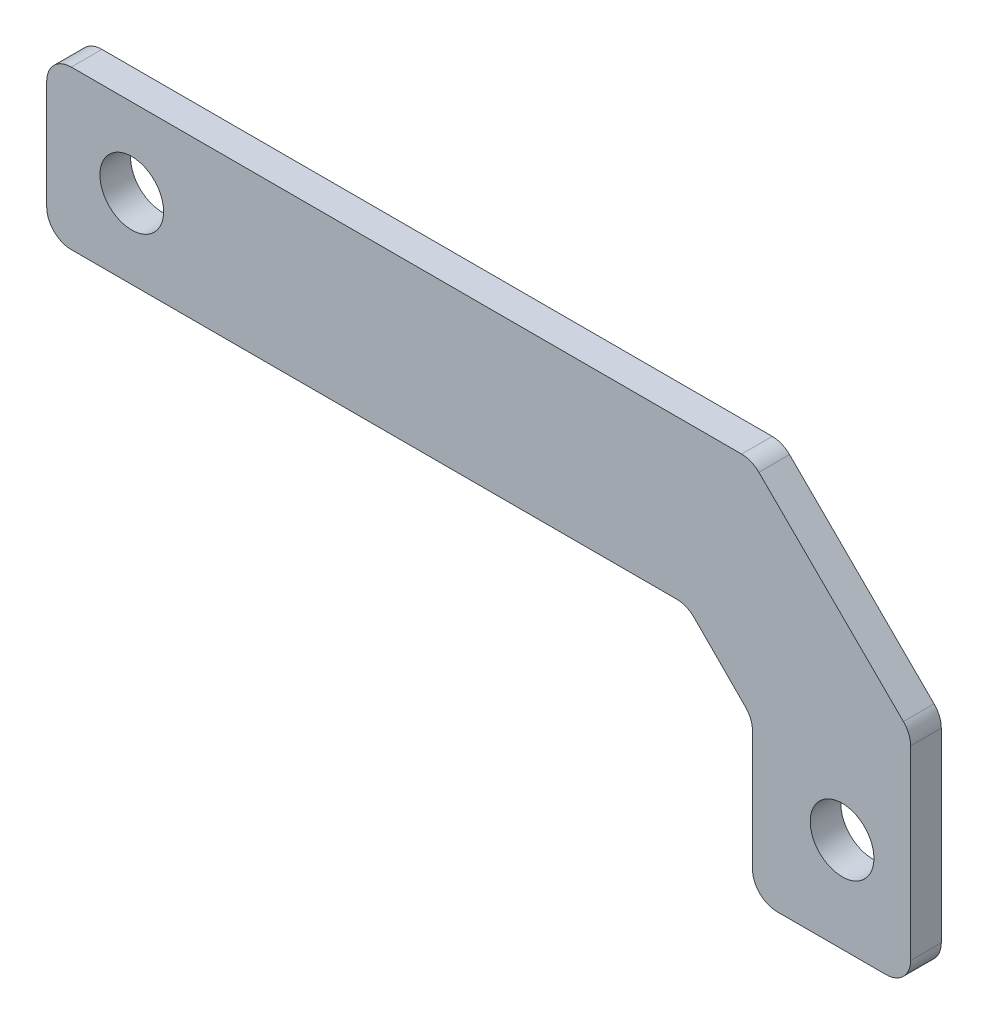
ISO-10303-21;
HEADER;
FILE_DESCRIPTION(('STEP AP214'),'2;1');
FILE_NAME('part.step','',(''),(''),'','','');
FILE_SCHEMA(('AUTOMOTIVE_DESIGN { 1 0 10303 214 1 1 1 1 }'));
ENDSEC;
DATA;
#1=APPLICATION_CONTEXT('core data for automotive mechanical design processes');
#2=APPLICATION_PROTOCOL_DEFINITION('international standard','automotive_design',2000,#1);
#3=PRODUCT_CONTEXT('',#1,'mechanical');
#4=PRODUCT('Part','Part','',(#3));
#5=PRODUCT_RELATED_PRODUCT_CATEGORY('part','',(#4));
#6=PRODUCT_DEFINITION_FORMATION('','',#4);
#7=PRODUCT_DEFINITION_CONTEXT('part definition',#1,'design');
#8=PRODUCT_DEFINITION('design','',#6,#7);
#9=PRODUCT_DEFINITION_SHAPE('','',#8);
#10=(LENGTH_UNIT() NAMED_UNIT(*) SI_UNIT(.MILLI.,.METRE.));
#11=(NAMED_UNIT(*) PLANE_ANGLE_UNIT() SI_UNIT($,.RADIAN.));
#12=(NAMED_UNIT(*) SI_UNIT($,.STERADIAN.) SOLID_ANGLE_UNIT());
#13=UNCERTAINTY_MEASURE_WITH_UNIT(LENGTH_MEASURE(1.E-05),#10,'distance_accuracy_value','');
#14=(GEOMETRIC_REPRESENTATION_CONTEXT(3) GLOBAL_UNCERTAINTY_ASSIGNED_CONTEXT((#13)) GLOBAL_UNIT_ASSIGNED_CONTEXT((#10,
#11,#12)) REPRESENTATION_CONTEXT('',''));
#15=CARTESIAN_POINT('',(0.,0.,0.));
#16=DIRECTION('',(0.,0.,1.));
#17=DIRECTION('',(1.,0.,0.));
#18=AXIS2_PLACEMENT_3D('',#15,#16,#17);
#19=CARTESIAN_POINT('',(-25.8191520170898,-78.501600001198,-3.175));
#20=DIRECTION('',(-1.,0.,0.));
#21=DIRECTION('',(0.,-1.,0.));
#22=AXIS2_PLACEMENT_3D('',#19,#20,#21);
#23=PLANE('',#22);
#24=DIRECTION('',(0.,-1.,0.));
#25=VECTOR('',#24,1.);
#26=CARTESIAN_POINT('',(-25.8191520170898,-78.501600001198,0.));
#27=LINE('',#26,#25);
#28=CARTESIAN_POINT('',(-25.8191520170898,-64.663600001198,0.));
#29=VERTEX_POINT('',#28);
#30=CARTESIAN_POINT('',(-25.8191520170898,-75.961600001198,0.));
#31=VERTEX_POINT('',#30);
#32=EDGE_CURVE('E278',#29,#31,#27,.T.);
#33=ORIENTED_EDGE('',*,*,#32,.F.);
#34=DIRECTION('',(0.,0.,1.));
#35=VECTOR('',#34,1.);
#36=CARTESIAN_POINT('',(-25.8191520170898,-64.663600001198,-3.175));
#37=LINE('',#36,#35);
#38=CARTESIAN_POINT('',(-25.8191520170898,-64.663600001198,-3.175));
#39=VERTEX_POINT('',#38);
#40=EDGE_CURVE('E237',#29,#39,#37,.F.);
#41=ORIENTED_EDGE('',*,*,#40,.T.);
#42=DIRECTION('',(0.,-1.,0.));
#43=VECTOR('',#42,1.);
#44=CARTESIAN_POINT('',(-25.8191520170898,-78.501600001198,-3.175));
#45=LINE('',#44,#43);
#46=CARTESIAN_POINT('',(-25.8191520170898,-75.961600001198,-3.175));
#47=VERTEX_POINT('',#46);
#48=EDGE_CURVE('E261',#39,#47,#45,.T.);
#49=ORIENTED_EDGE('',*,*,#48,.T.);
#50=DIRECTION('',(0.,0.,1.));
#51=VECTOR('',#50,1.);
#52=CARTESIAN_POINT('',(-25.8191520170898,-75.961600001198,-3.175));
#53=LINE('',#52,#51);
#54=EDGE_CURVE('E234',#47,#31,#53,.T.);
#55=ORIENTED_EDGE('',*,*,#54,.T.);
#56=EDGE_LOOP('',(#33,#41,#49,#55));
#57=FACE_BOUND('',#56,.T.);
#58=ADVANCED_FACE('F40',(#57),#23,.T.);
#59=CARTESIAN_POINT('',(47.2058479829102,-62.123600001198,-3.175));
#60=DIRECTION('',(0.,1.,0.));
#61=DIRECTION('',(0.,0.,1.));
#62=AXIS2_PLACEMENT_3D('',#59,#60,#61);
#63=PLANE('',#62);
#64=DIRECTION('',(-1.,0.,0.));
#65=VECTOR('',#64,1.);
#66=CARTESIAN_POINT('',(47.2058479829102,-62.123600001198,0.));
#67=LINE('',#66,#65);
#68=CARTESIAN_POINT('',(46.1585043401581,-62.123600001198,0.));
#69=VERTEX_POINT('',#68);
#70=CARTESIAN_POINT('',(-23.2791520170898,-62.123600001198,0.));
#71=VERTEX_POINT('',#70);
#72=EDGE_CURVE('E174',#69,#71,#67,.T.);
#73=ORIENTED_EDGE('',*,*,#72,.F.);
#74=DIRECTION('',(0.,0.,1.));
#75=VECTOR('',#74,1.);
#76=CARTESIAN_POINT('',(46.1585043401581,-62.123600001198,-3.175));
#77=LINE('',#76,#75);
#78=CARTESIAN_POINT('',(46.1585043401581,-62.123600001198,-3.175));
#79=VERTEX_POINT('',#78);
#80=EDGE_CURVE('E198',#69,#79,#77,.F.);
#81=ORIENTED_EDGE('',*,*,#80,.T.);
#82=DIRECTION('',(-1.,0.,0.));
#83=VECTOR('',#82,1.);
#84=CARTESIAN_POINT('',(47.2058479829102,-62.123600001198,-3.175));
#85=LINE('',#84,#83);
#86=CARTESIAN_POINT('',(-23.2791520170898,-62.123600001198,-3.175));
#87=VERTEX_POINT('',#86);
#88=EDGE_CURVE('E179',#79,#87,#85,.T.);
#89=ORIENTED_EDGE('',*,*,#88,.T.);
#90=DIRECTION('',(0.,0.,1.));
#91=VECTOR('',#90,1.);
#92=CARTESIAN_POINT('',(-23.2791520170898,-62.123600001198,-3.175));
#93=LINE('',#92,#91);
#94=EDGE_CURVE('E195',#87,#71,#93,.T.);
#95=ORIENTED_EDGE('',*,*,#94,.T.);
#96=EDGE_LOOP('',(#73,#81,#89,#95));
#97=FACE_BOUND('',#96,.T.);
#98=ADVANCED_FACE('F319',(#97),#63,.T.);
#99=CARTESIAN_POINT('',(63.6677250495303,-78.4804417272799,-3.175));
#100=DIRECTION('',(0.704840096977084,0.709366222548927,0.));
#101=DIRECTION('',(-0.709366222548927,0.704840096977085,0.));
#102=AXIS2_PLACEMENT_3D('',#99,#100,#101);
#103=PLANE('',#102);
#104=DIRECTION('',(-0.709366222548927,0.704840096977085,0.));
#105=VECTOR('',#104,1.);
#106=CARTESIAN_POINT('',(63.6677250495303,-78.4804417272799,-3.175));
#107=LINE('',#106,#105);
#108=CARTESIAN_POINT('',(62.9180188958521,-77.7355190889223,-3.175));
#109=VERTEX_POINT('',#108);
#110=CARTESIAN_POINT('',(47.9487981864799,-62.8618097959237,-3.175));
#111=VERTEX_POINT('',#110);
#112=EDGE_CURVE('E184',#109,#111,#107,.T.);
#113=ORIENTED_EDGE('',*,*,#112,.T.);
#114=DIRECTION('',(0.,0.,1.));
#115=VECTOR('',#114,1.);
#116=CARTESIAN_POINT('',(47.9487981864799,-62.8618097959237,-3.175));
#117=LINE('',#116,#115);
#118=CARTESIAN_POINT('',(47.9487981864799,-62.8618097959237,0.));
#119=VERTEX_POINT('',#118);
#120=EDGE_CURVE('E173',#111,#119,#117,.T.);
#121=ORIENTED_EDGE('',*,*,#120,.T.);
#122=DIRECTION('',(-0.709366222548927,0.704840096977085,0.));
#123=VECTOR('',#122,1.);
#124=CARTESIAN_POINT('',(63.6677250495303,-78.4804417272799,0.));
#125=LINE('',#124,#123);
#126=CARTESIAN_POINT('',(62.9180188958521,-77.7355190889223,0.));
#127=VERTEX_POINT('',#126);
#128=EDGE_CURVE('E156',#127,#119,#125,.T.);
#129=ORIENTED_EDGE('',*,*,#128,.F.);
#130=DIRECTION('',(0.,0.,1.));
#131=VECTOR('',#130,1.);
#132=CARTESIAN_POINT('',(62.9180188958521,-77.7355190889223,-3.175));
#133=LINE('',#132,#131);
#134=EDGE_CURVE('E170',#127,#109,#133,.F.);
#135=ORIENTED_EDGE('',*,*,#134,.T.);
#136=EDGE_LOOP('',(#113,#121,#129,#135));
#137=FACE_BOUND('',#136,.T.);
#138=ADVANCED_FACE('F169',(#137),#103,.T.);
#139=CARTESIAN_POINT('',(63.6677250495303,-78.4804417272799,-3.175));
#140=DIRECTION('',(1.,0.,0.));
#141=DIRECTION('',(0.,0.,-1.));
#142=AXIS2_PLACEMENT_3D('',#139,#140,#141);
#143=PLANE('',#142);
#144=DIRECTION('',(0.,1.,0.));
#145=VECTOR('',#144,1.);
#146=CARTESIAN_POINT('',(63.6677250495303,-78.4804417272799,-3.175));
#147=LINE('',#146,#145);
#148=CARTESIAN_POINT('',(63.6677250495303,-98.8004417272799,-3.175));
#149=VERTEX_POINT('',#148);
#150=CARTESIAN_POINT('',(63.6677250495303,-79.5373092941966,-3.175));
#151=VERTEX_POINT('',#150);
#152=EDGE_CURVE('E274',#149,#151,#147,.T.);
#153=ORIENTED_EDGE('',*,*,#152,.T.);
#154=DIRECTION('',(0.,0.,1.));
#155=VECTOR('',#154,1.);
#156=CARTESIAN_POINT('',(63.6677250495303,-79.5373092941966,-3.175));
#157=LINE('',#156,#155);
#158=CARTESIAN_POINT('',(63.6677250495303,-79.5373092941966,0.));
#159=VERTEX_POINT('',#158);
#160=EDGE_CURVE('E213',#151,#159,#157,.T.);
#161=ORIENTED_EDGE('',*,*,#160,.T.);
#162=DIRECTION('',(0.,1.,0.));
#163=VECTOR('',#162,1.);
#164=CARTESIAN_POINT('',(63.6677250495303,-78.4804417272799,0.));
#165=LINE('',#164,#163);
#166=CARTESIAN_POINT('',(63.6677250495303,-98.8004417272799,0.));
#167=VERTEX_POINT('',#166);
#168=EDGE_CURVE('E158',#167,#159,#165,.T.);
#169=ORIENTED_EDGE('',*,*,#168,.F.);
#170=DIRECTION('',(0.,0.,1.));
#171=VECTOR('',#170,1.);
#172=CARTESIAN_POINT('',(63.6677250495303,-98.8004417272799,-3.175));
#173=LINE('',#172,#171);
#174=EDGE_CURVE('E211',#167,#149,#173,.F.);
#175=ORIENTED_EDGE('',*,*,#174,.T.);
#176=EDGE_LOOP('',(#153,#161,#169,#175));
#177=FACE_BOUND('',#176,.T.);
#178=ADVANCED_FACE('F369',(#177),#143,.T.);
#179=CARTESIAN_POINT('',(63.6677250495303,-101.34044172728,-3.175));
#180=DIRECTION('',(0.,-1.,0.));
#181=DIRECTION('',(0.,0.,-1.));
#182=AXIS2_PLACEMENT_3D('',#179,#180,#181);
#183=PLANE('',#182);
#184=DIRECTION('',(1.,0.,0.));
#185=VECTOR('',#184,1.);
#186=CARTESIAN_POINT('',(63.6677250495303,-101.34044172728,-3.175));
#187=LINE('',#186,#185);
#188=CARTESIAN_POINT('',(49.8297250495303,-101.34044172728,-3.175));
#189=VERTEX_POINT('',#188);
#190=CARTESIAN_POINT('',(61.1277250495303,-101.34044172728,-3.175));
#191=VERTEX_POINT('',#190);
#192=EDGE_CURVE('E271',#189,#191,#187,.T.);
#193=ORIENTED_EDGE('',*,*,#192,.T.);
#194=DIRECTION('',(0.,0.,1.));
#195=VECTOR('',#194,1.);
#196=CARTESIAN_POINT('',(61.1277250495303,-101.34044172728,-3.175));
#197=LINE('',#196,#195);
#198=CARTESIAN_POINT('',(61.1277250495303,-101.34044172728,0.));
#199=VERTEX_POINT('',#198);
#200=EDGE_CURVE('E231',#191,#199,#197,.T.);
#201=ORIENTED_EDGE('',*,*,#200,.T.);
#202=DIRECTION('',(1.,0.,0.));
#203=VECTOR('',#202,1.);
#204=CARTESIAN_POINT('',(63.6677250495303,-101.34044172728,0.));
#205=LINE('',#204,#203);
#206=CARTESIAN_POINT('',(49.8297250495303,-101.34044172728,0.));
#207=VERTEX_POINT('',#206);
#208=EDGE_CURVE('E285',#207,#199,#205,.T.);
#209=ORIENTED_EDGE('',*,*,#208,.F.);
#210=DIRECTION('',(0.,0.,1.));
#211=VECTOR('',#210,1.);
#212=CARTESIAN_POINT('',(49.8297250495303,-101.34044172728,-3.175));
#213=LINE('',#212,#211);
#214=EDGE_CURVE('E229',#207,#189,#213,.F.);
#215=ORIENTED_EDGE('',*,*,#214,.T.);
#216=EDGE_LOOP('',(#193,#201,#209,#215));
#217=FACE_BOUND('',#216,.T.);
#218=ADVANCED_FACE('F291',(#217),#183,.T.);
#219=CARTESIAN_POINT('',(47.2897250495303,-85.3384417272799,-3.175));
#220=DIRECTION('',(-1.,0.,0.));
#221=DIRECTION('',(0.,0.,1.));
#222=AXIS2_PLACEMENT_3D('',#219,#220,#221);
#223=PLANE('',#222);
#224=DIRECTION('',(0.,-1.,0.));
#225=VECTOR('',#224,1.);
#226=CARTESIAN_POINT('',(47.2897250495303,-85.3384417272799,0.));
#227=LINE('',#226,#225);
#228=CARTESIAN_POINT('',(47.2897250495303,-86.3858291351187,0.));
#229=VERTEX_POINT('',#228);
#230=CARTESIAN_POINT('',(47.2897250495303,-98.8004417272799,0.));
#231=VERTEX_POINT('',#230);
#232=EDGE_CURVE('E254',#229,#231,#227,.T.);
#233=ORIENTED_EDGE('',*,*,#232,.F.);
#234=DIRECTION('',(0.,0.,1.));
#235=VECTOR('',#234,1.);
#236=CARTESIAN_POINT('',(47.2897250495303,-86.3858291351187,-3.175));
#237=LINE('',#236,#235);
#238=CARTESIAN_POINT('',(47.2897250495303,-86.3858291351187,-3.175));
#239=VERTEX_POINT('',#238);
#240=EDGE_CURVE('E223',#229,#239,#237,.F.);
#241=ORIENTED_EDGE('',*,*,#240,.T.);
#242=DIRECTION('',(0.,-1.,0.));
#243=VECTOR('',#242,1.);
#244=CARTESIAN_POINT('',(47.2897250495303,-85.3384417272799,-3.175));
#245=LINE('',#244,#243);
#246=CARTESIAN_POINT('',(47.2897250495303,-98.8004417272799,-3.175));
#247=VERTEX_POINT('',#246);
#248=EDGE_CURVE('E263',#239,#247,#245,.T.);
#249=ORIENTED_EDGE('',*,*,#248,.T.);
#250=DIRECTION('',(0.,0.,1.));
#251=VECTOR('',#250,1.);
#252=CARTESIAN_POINT('',(47.2897250495303,-98.8004417272799,-3.175));
#253=LINE('',#252,#251);
#254=EDGE_CURVE('E220',#247,#231,#253,.T.);
#255=ORIENTED_EDGE('',*,*,#254,.T.);
#256=EDGE_LOOP('',(#233,#241,#249,#255));
#257=FACE_BOUND('',#256,.T.);
#258=ADVANCED_FACE('F304',(#257),#223,.T.);
#259=CARTESIAN_POINT('',(40.496105752232,-78.501600001198,-3.175));
#260=DIRECTION('',(-0.709345462728307,-0.704860989491378,0.));
#261=DIRECTION('',(0.704860989491378,-0.709345462728307,0.));
#262=AXIS2_PLACEMENT_3D('',#259,#260,#261);
#263=PLANE('',#262);
#264=DIRECTION('',(0.704860989491378,-0.709345462728307,0.));
#265=VECTOR('',#264,1.);
#266=CARTESIAN_POINT('',(40.496105752232,-78.501600001198,-3.175));
#267=LINE('',#266,#265);
#268=CARTESIAN_POINT('',(41.2410195413871,-79.2512530878899,-3.175));
#269=VERTEX_POINT('',#268);
#270=CARTESIAN_POINT('',(46.5514625248602,-84.5954822218106,-3.175));
#271=VERTEX_POINT('',#270);
#272=EDGE_CURVE('E260',#269,#271,#267,.T.);
#273=ORIENTED_EDGE('',*,*,#272,.T.);
#274=DIRECTION('',(0.,0.,1.));
#275=VECTOR('',#274,1.);
#276=CARTESIAN_POINT('',(46.5514625248602,-84.5954822218106,0.));
#277=LINE('',#276,#275);
#278=CARTESIAN_POINT('',(46.5514625248602,-84.5954822218106,0.));
#279=VERTEX_POINT('',#278);
#280=EDGE_CURVE('E217',#271,#279,#277,.T.);
#281=ORIENTED_EDGE('',*,*,#280,.T.);
#282=DIRECTION('',(0.704860989491378,-0.709345462728307,0.));
#283=VECTOR('',#282,1.);
#284=CARTESIAN_POINT('',(40.496105752232,-78.501600001198,0.));
#285=LINE('',#284,#283);
#286=CARTESIAN_POINT('',(41.2410195413871,-79.2512530878899,0.));
#287=VERTEX_POINT('',#286);
#288=EDGE_CURVE('E245',#287,#279,#285,.T.);
#289=ORIENTED_EDGE('',*,*,#288,.F.);
#290=DIRECTION('',(0.,0.,1.));
#291=VECTOR('',#290,1.);
#292=CARTESIAN_POINT('',(41.2410195413871,-79.2512530878899,-3.175));
#293=LINE('',#292,#291);
#294=EDGE_CURVE('E215',#287,#269,#293,.F.);
#295=ORIENTED_EDGE('',*,*,#294,.T.);
#296=EDGE_LOOP('',(#273,#281,#289,#295));
#297=FACE_BOUND('',#296,.T.);
#298=ADVANCED_FACE('F252',(#297),#263,.T.);
#299=CARTESIAN_POINT('',(40.496105752232,-78.501600001198,-3.175));
#300=DIRECTION('',(0.,-1.,0.));
#301=DIRECTION('',(0.,0.,-1.));
#302=AXIS2_PLACEMENT_3D('',#299,#300,#301);
#303=PLANE('',#302);
#304=DIRECTION('',(1.,0.,0.));
#305=VECTOR('',#304,1.);
#306=CARTESIAN_POINT('',(40.496105752232,-78.501600001198,-3.175));
#307=LINE('',#306,#305);
#308=CARTESIAN_POINT('',(-23.2791520170898,-78.501600001198,-3.175));
#309=VERTEX_POINT('',#308);
#310=CARTESIAN_POINT('',(39.4392820660572,-78.501600001198,-3.175));
#311=VERTEX_POINT('',#310);
#312=EDGE_CURVE('E258',#309,#311,#307,.T.);
#313=ORIENTED_EDGE('',*,*,#312,.T.);
#314=DIRECTION('',(0.,0.,1.));
#315=VECTOR('',#314,1.);
#316=CARTESIAN_POINT('',(39.4392820660572,-78.501600001198,0.));
#317=LINE('',#316,#315);
#318=CARTESIAN_POINT('',(39.4392820660572,-78.501600001198,0.));
#319=VERTEX_POINT('',#318);
#320=EDGE_CURVE('E226',#311,#319,#317,.T.);
#321=ORIENTED_EDGE('',*,*,#320,.T.);
#322=DIRECTION('',(1.,0.,0.));
#323=VECTOR('',#322,1.);
#324=CARTESIAN_POINT('',(40.496105752232,-78.501600001198,0.));
#325=LINE('',#324,#323);
#326=CARTESIAN_POINT('',(-23.2791520170898,-78.501600001198,0.));
#327=VERTEX_POINT('',#326);
#328=EDGE_CURVE('E246',#327,#319,#325,.T.);
#329=ORIENTED_EDGE('',*,*,#328,.F.);
#330=DIRECTION('',(0.,0.,1.));
#331=VECTOR('',#330,1.);
#332=CARTESIAN_POINT('',(-23.2791520170898,-78.501600001198,-3.175));
#333=LINE('',#332,#331);
#334=EDGE_CURVE('E60',#327,#309,#333,.F.);
#335=ORIENTED_EDGE('',*,*,#334,.T.);
#336=EDGE_LOOP('',(#313,#321,#329,#335));
#337=FACE_BOUND('',#336,.T.);
#338=ADVANCED_FACE('F257',(#337),#303,.T.);
#339=CARTESIAN_POINT('',(0.,0.,-3.175));
#340=DIRECTION('',(0.,0.,1.));
#341=DIRECTION('',(1.,0.,0.));
#342=AXIS2_PLACEMENT_3D('',#339,#340,#341);
#343=PLANE('',#342);
#344=CARTESIAN_POINT('',(56.5659190476231,-91.5356104977107,-3.175));
#345=DIRECTION('',(0.,0.,1.));
#346=DIRECTION('',(1.,0.,0.));
#347=AXIS2_PLACEMENT_3D('',#344,#345,#346);
#348=CIRCLE('',#347,3.3);
#349=CARTESIAN_POINT('',(59.8659190476231,-91.5356104977107,-3.175));
#350=VERTEX_POINT('',#349);
#351=EDGE_CURVE('E408',#350,#350,#348,.T.);
#352=ORIENTED_EDGE('',*,*,#351,.T.);
#353=EDGE_LOOP('',(#352));
#354=FACE_BOUND('',#353,.T.);
#355=CARTESIAN_POINT('',(-17.0118999999956,-70.312600001199,-3.175));
#356=DIRECTION('',(0.,0.,1.));
#357=DIRECTION('',(1.,0.,0.));
#358=AXIS2_PLACEMENT_3D('',#355,#356,#357);
#359=CIRCLE('',#358,3.3);
#360=CARTESIAN_POINT('',(-13.7118999999956,-70.312600001199,-3.175));
#361=VERTEX_POINT('',#360);
#362=EDGE_CURVE('E281',#361,#361,#359,.T.);
#363=ORIENTED_EDGE('',*,*,#362,.T.);
#364=EDGE_LOOP('',(#363));
#365=FACE_BOUND('',#364,.T.);
#366=ORIENTED_EDGE('',*,*,#88,.F.);
#367=CARTESIAN_POINT('',(46.1585043401581,-64.663600001198,-3.175));
#368=DIRECTION('',(0.,0.,1.));
#369=DIRECTION('',(1.,0.,0.));
#370=AXIS2_PLACEMENT_3D('',#367,#368,#369);
#371=CIRCLE('',#370,2.54);
#372=EDGE_CURVE('E209',#79,#111,#371,.F.);
#373=ORIENTED_EDGE('',*,*,#372,.T.);
#374=ORIENTED_EDGE('',*,*,#112,.F.);
#375=CARTESIAN_POINT('',(61.1277250495303,-79.5373092941966,-3.175));
#376=DIRECTION('',(0.,0.,1.));
#377=DIRECTION('',(1.,0.,0.));
#378=AXIS2_PLACEMENT_3D('',#375,#376,#377);
#379=CIRCLE('',#378,2.54);
#380=EDGE_CURVE('E178',#109,#151,#379,.F.);
#381=ORIENTED_EDGE('',*,*,#380,.T.);
#382=ORIENTED_EDGE('',*,*,#152,.F.);
#383=CARTESIAN_POINT('',(61.1277250495303,-98.8004417272799,-3.175));
#384=DIRECTION('',(0.,0.,1.));
#385=DIRECTION('',(1.,0.,0.));
#386=AXIS2_PLACEMENT_3D('',#383,#384,#385);
#387=CIRCLE('',#386,2.54);
#388=EDGE_CURVE('E206',#149,#191,#387,.F.);
#389=ORIENTED_EDGE('',*,*,#388,.T.);
#390=ORIENTED_EDGE('',*,*,#192,.F.);
#391=CARTESIAN_POINT('',(49.8297250495303,-98.8004417272799,-3.175));
#392=DIRECTION('',(0.,0.,1.));
#393=DIRECTION('',(1.,0.,0.));
#394=AXIS2_PLACEMENT_3D('',#391,#392,#393);
#395=CIRCLE('',#394,2.54);
#396=EDGE_CURVE('E204',#189,#247,#395,.F.);
#397=ORIENTED_EDGE('',*,*,#396,.T.);
#398=ORIENTED_EDGE('',*,*,#248,.F.);
#399=CARTESIAN_POINT('',(44.7497250495303,-86.3858291351187,-3.175));
#400=DIRECTION('',(0.,0.,1.));
#401=DIRECTION('',(1.,0.,0.));
#402=AXIS2_PLACEMENT_3D('',#399,#400,#401);
#403=CIRCLE('',#402,2.54);
#404=EDGE_CURVE('E241',#239,#271,#403,.T.);
#405=ORIENTED_EDGE('',*,*,#404,.T.);
#406=ORIENTED_EDGE('',*,*,#272,.F.);
#407=CARTESIAN_POINT('',(39.4392820660572,-81.041600001198,-3.175));
#408=DIRECTION('',(0.,0.,1.));
#409=DIRECTION('',(1.,0.,0.));
#410=AXIS2_PLACEMENT_3D('',#407,#408,#409);
#411=CIRCLE('',#410,2.54);
#412=EDGE_CURVE('E11',#269,#311,#411,.T.);
#413=ORIENTED_EDGE('',*,*,#412,.T.);
#414=ORIENTED_EDGE('',*,*,#312,.F.);
#415=CARTESIAN_POINT('',(-23.2791520170898,-75.961600001198,-3.175));
#416=DIRECTION('',(0.,0.,1.));
#417=DIRECTION('',(1.,0.,0.));
#418=AXIS2_PLACEMENT_3D('',#415,#416,#417);
#419=CIRCLE('',#418,2.54);
#420=EDGE_CURVE('E200',#309,#47,#419,.F.);
#421=ORIENTED_EDGE('',*,*,#420,.T.);
#422=ORIENTED_EDGE('',*,*,#48,.F.);
#423=CARTESIAN_POINT('',(-23.2791520170898,-64.663600001198,-3.175));
#424=DIRECTION('',(0.,0.,1.));
#425=DIRECTION('',(1.,0.,0.));
#426=AXIS2_PLACEMENT_3D('',#423,#424,#425);
#427=CIRCLE('',#426,2.54);
#428=EDGE_CURVE('E202',#39,#87,#427,.F.);
#429=ORIENTED_EDGE('',*,*,#428,.T.);
#430=EDGE_LOOP('',(#366,#373,#374,#381,#382,#389,#390,#397,#398,#405,#406,#413,#414,#421,#422,#429));
#431=FACE_BOUND('',#430,.T.);
#432=ADVANCED_FACE('F300',(#354,#365,#431),#343,.F.);
#433=CARTESIAN_POINT('',(0.,0.,0.));
#434=DIRECTION('',(0.,0.,1.));
#435=DIRECTION('',(1.,0.,0.));
#436=AXIS2_PLACEMENT_3D('',#433,#434,#435);
#437=PLANE('',#436);
#438=CARTESIAN_POINT('',(56.5659190476231,-91.5356104977107,0.));
#439=DIRECTION('',(0.,0.,1.));
#440=DIRECTION('',(1.,0.,0.));
#441=AXIS2_PLACEMENT_3D('',#438,#439,#440);
#442=CIRCLE('',#441,3.3);
#443=CARTESIAN_POINT('',(59.8659190476231,-91.5356104977107,0.));
#444=VERTEX_POINT('',#443);
#445=EDGE_CURVE('E410',#444,#444,#442,.T.);
#446=ORIENTED_EDGE('',*,*,#445,.F.);
#447=EDGE_LOOP('',(#446));
#448=FACE_BOUND('',#447,.T.);
#449=CARTESIAN_POINT('',(-17.0118999999956,-70.312600001199,0.));
#450=DIRECTION('',(0.,0.,1.));
#451=DIRECTION('',(1.,0.,0.));
#452=AXIS2_PLACEMENT_3D('',#449,#450,#451);
#453=CIRCLE('',#452,3.3);
#454=CARTESIAN_POINT('',(-13.7118999999956,-70.312600001199,0.));
#455=VERTEX_POINT('',#454);
#456=EDGE_CURVE('E406',#455,#455,#453,.T.);
#457=ORIENTED_EDGE('',*,*,#456,.F.);
#458=EDGE_LOOP('',(#457));
#459=FACE_BOUND('',#458,.T.);
#460=ORIENTED_EDGE('',*,*,#128,.T.);
#461=CARTESIAN_POINT('',(46.1585043401581,-64.663600001198,0.));
#462=DIRECTION('',(0.,0.,1.));
#463=DIRECTION('',(1.,0.,0.));
#464=AXIS2_PLACEMENT_3D('',#461,#462,#463);
#465=CIRCLE('',#464,2.54);
#466=EDGE_CURVE('E163',#119,#69,#465,.T.);
#467=ORIENTED_EDGE('',*,*,#466,.T.);
#468=ORIENTED_EDGE('',*,*,#72,.T.);
#469=CARTESIAN_POINT('',(-23.2791520170898,-64.663600001198,0.));
#470=DIRECTION('',(0.,0.,1.));
#471=DIRECTION('',(1.,0.,0.));
#472=AXIS2_PLACEMENT_3D('',#469,#470,#471);
#473=CIRCLE('',#472,2.54);
#474=EDGE_CURVE('E189',#71,#29,#473,.T.);
#475=ORIENTED_EDGE('',*,*,#474,.T.);
#476=ORIENTED_EDGE('',*,*,#32,.T.);
#477=CARTESIAN_POINT('',(-23.2791520170898,-75.961600001198,0.));
#478=DIRECTION('',(0.,0.,1.));
#479=DIRECTION('',(1.,0.,0.));
#480=AXIS2_PLACEMENT_3D('',#477,#478,#479);
#481=CIRCLE('',#480,2.54);
#482=EDGE_CURVE('E181',#31,#327,#481,.T.);
#483=ORIENTED_EDGE('',*,*,#482,.T.);
#484=ORIENTED_EDGE('',*,*,#328,.T.);
#485=CARTESIAN_POINT('',(39.4392820660572,-81.041600001198,0.));
#486=DIRECTION('',(0.,0.,1.));
#487=DIRECTION('',(1.,0.,0.));
#488=AXIS2_PLACEMENT_3D('',#485,#486,#487);
#489=CIRCLE('',#488,2.54);
#490=EDGE_CURVE('E48',#319,#287,#489,.F.);
#491=ORIENTED_EDGE('',*,*,#490,.T.);
#492=ORIENTED_EDGE('',*,*,#288,.T.);
#493=CARTESIAN_POINT('',(44.7497250495303,-86.3858291351187,0.));
#494=DIRECTION('',(0.,0.,1.));
#495=DIRECTION('',(1.,0.,0.));
#496=AXIS2_PLACEMENT_3D('',#493,#494,#495);
#497=CIRCLE('',#496,2.54);
#498=EDGE_CURVE('E239',#279,#229,#497,.F.);
#499=ORIENTED_EDGE('',*,*,#498,.T.);
#500=ORIENTED_EDGE('',*,*,#232,.T.);
#501=CARTESIAN_POINT('',(49.8297250495303,-98.8004417272799,0.));
#502=DIRECTION('',(0.,0.,1.));
#503=DIRECTION('',(1.,0.,0.));
#504=AXIS2_PLACEMENT_3D('',#501,#502,#503);
#505=CIRCLE('',#504,2.54);
#506=EDGE_CURVE('E191',#231,#207,#505,.T.);
#507=ORIENTED_EDGE('',*,*,#506,.T.);
#508=ORIENTED_EDGE('',*,*,#208,.T.);
#509=CARTESIAN_POINT('',(61.1277250495303,-98.8004417272799,0.));
#510=DIRECTION('',(0.,0.,1.));
#511=DIRECTION('',(1.,0.,0.));
#512=AXIS2_PLACEMENT_3D('',#509,#510,#511);
#513=CIRCLE('',#512,2.54);
#514=EDGE_CURVE('E164',#199,#167,#513,.T.);
#515=ORIENTED_EDGE('',*,*,#514,.T.);
#516=ORIENTED_EDGE('',*,*,#168,.T.);
#517=CARTESIAN_POINT('',(61.1277250495303,-79.5373092941966,0.));
#518=DIRECTION('',(0.,0.,1.));
#519=DIRECTION('',(1.,0.,0.));
#520=AXIS2_PLACEMENT_3D('',#517,#518,#519);
#521=CIRCLE('',#520,2.54);
#522=EDGE_CURVE('E153',#159,#127,#521,.T.);
#523=ORIENTED_EDGE('',*,*,#522,.T.);
#524=EDGE_LOOP('',(#460,#467,#468,#475,#476,#483,#484,#491,#492,#499,#500,#507,#508,#515,#516,#523));
#525=FACE_BOUND('',#524,.T.);
#526=ADVANCED_FACE('F155',(#448,#459,#525),#437,.T.);
#527=CARTESIAN_POINT('',(-17.0118999999956,-70.312600001199,0.));
#528=DIRECTION('',(0.,0.,1.));
#529=DIRECTION('',(1.,0.,0.));
#530=AXIS2_PLACEMENT_3D('',#527,#528,#529);
#531=CYLINDRICAL_SURFACE('',#530,3.3);
#532=ORIENTED_EDGE('',*,*,#362,.F.);
#533=EDGE_LOOP('',(#532));
#534=FACE_BOUND('',#533,.T.);
#535=ORIENTED_EDGE('',*,*,#456,.T.);
#536=EDGE_LOOP('',(#535));
#537=FACE_BOUND('',#536,.T.);
#538=ADVANCED_FACE('F337',(#534,#537),#531,.F.);
#539=CARTESIAN_POINT('',(56.5659190476231,-91.5356104977107,0.));
#540=DIRECTION('',(0.,0.,1.));
#541=DIRECTION('',(1.,0.,0.));
#542=AXIS2_PLACEMENT_3D('',#539,#540,#541);
#543=CYLINDRICAL_SURFACE('',#542,3.3);
#544=ORIENTED_EDGE('',*,*,#351,.F.);
#545=EDGE_LOOP('',(#544));
#546=FACE_BOUND('',#545,.T.);
#547=ORIENTED_EDGE('',*,*,#445,.T.);
#548=EDGE_LOOP('',(#547));
#549=FACE_BOUND('',#548,.T.);
#550=ADVANCED_FACE('F332',(#546,#549),#543,.F.);
#551=CARTESIAN_POINT('',(46.1585043401581,-64.663600001198,-3.175));
#552=DIRECTION('',(0.,0.,1.));
#553=DIRECTION('',(1.,0.,0.));
#554=AXIS2_PLACEMENT_3D('',#551,#552,#553);
#555=CYLINDRICAL_SURFACE('',#554,2.54);
#556=ORIENTED_EDGE('',*,*,#372,.F.);
#557=ORIENTED_EDGE('',*,*,#80,.F.);
#558=ORIENTED_EDGE('',*,*,#466,.F.);
#559=ORIENTED_EDGE('',*,*,#120,.F.);
#560=EDGE_LOOP('',(#556,#557,#558,#559));
#561=FACE_BOUND('',#560,.T.);
#562=ADVANCED_FACE('F316',(#561),#555,.T.);
#563=CARTESIAN_POINT('',(61.1277250495303,-79.5373092941966,-3.175));
#564=DIRECTION('',(0.,0.,1.));
#565=DIRECTION('',(1.,0.,0.));
#566=AXIS2_PLACEMENT_3D('',#563,#564,#565);
#567=CYLINDRICAL_SURFACE('',#566,2.54);
#568=ORIENTED_EDGE('',*,*,#380,.F.);
#569=ORIENTED_EDGE('',*,*,#134,.F.);
#570=ORIENTED_EDGE('',*,*,#522,.F.);
#571=ORIENTED_EDGE('',*,*,#160,.F.);
#572=EDGE_LOOP('',(#568,#569,#570,#571));
#573=FACE_BOUND('',#572,.T.);
#574=ADVANCED_FACE('F177',(#573),#567,.T.);
#575=CARTESIAN_POINT('',(44.7497250495303,-86.3858291351187,-3.175));
#576=DIRECTION('',(0.,0.,-1.));
#577=DIRECTION('',(-1.,0.,0.));
#578=AXIS2_PLACEMENT_3D('',#575,#576,#577);
#579=CYLINDRICAL_SURFACE('',#578,2.54);
#580=ORIENTED_EDGE('',*,*,#404,.F.);
#581=ORIENTED_EDGE('',*,*,#240,.F.);
#582=ORIENTED_EDGE('',*,*,#498,.F.);
#583=ORIENTED_EDGE('',*,*,#280,.F.);
#584=EDGE_LOOP('',(#580,#581,#582,#583));
#585=FACE_BOUND('',#584,.T.);
#586=ADVANCED_FACE('F307',(#585),#579,.F.);
#587=CARTESIAN_POINT('',(39.4392820660572,-81.041600001198,-3.175));
#588=DIRECTION('',(0.,0.,-1.));
#589=DIRECTION('',(-1.,0.,0.));
#590=AXIS2_PLACEMENT_3D('',#587,#588,#589);
#591=CYLINDRICAL_SURFACE('',#590,2.54);
#592=ORIENTED_EDGE('',*,*,#412,.F.);
#593=ORIENTED_EDGE('',*,*,#294,.F.);
#594=ORIENTED_EDGE('',*,*,#490,.F.);
#595=ORIENTED_EDGE('',*,*,#320,.F.);
#596=EDGE_LOOP('',(#592,#593,#594,#595));
#597=FACE_BOUND('',#596,.T.);
#598=ADVANCED_FACE('F256',(#597),#591,.F.);
#599=CARTESIAN_POINT('',(61.1277250495303,-98.8004417272799,-3.175));
#600=DIRECTION('',(0.,0.,1.));
#601=DIRECTION('',(1.,0.,0.));
#602=AXIS2_PLACEMENT_3D('',#599,#600,#601);
#603=CYLINDRICAL_SURFACE('',#602,2.54);
#604=ORIENTED_EDGE('',*,*,#388,.F.);
#605=ORIENTED_EDGE('',*,*,#174,.F.);
#606=ORIENTED_EDGE('',*,*,#514,.F.);
#607=ORIENTED_EDGE('',*,*,#200,.F.);
#608=EDGE_LOOP('',(#604,#605,#606,#607));
#609=FACE_BOUND('',#608,.T.);
#610=ADVANCED_FACE('F314',(#609),#603,.T.);
#611=CARTESIAN_POINT('',(49.8297250495303,-98.8004417272799,-3.175));
#612=DIRECTION('',(0.,0.,1.));
#613=DIRECTION('',(1.,0.,0.));
#614=AXIS2_PLACEMENT_3D('',#611,#612,#613);
#615=CYLINDRICAL_SURFACE('',#614,2.54);
#616=ORIENTED_EDGE('',*,*,#396,.F.);
#617=ORIENTED_EDGE('',*,*,#214,.F.);
#618=ORIENTED_EDGE('',*,*,#506,.F.);
#619=ORIENTED_EDGE('',*,*,#254,.F.);
#620=EDGE_LOOP('',(#616,#617,#618,#619));
#621=FACE_BOUND('',#620,.T.);
#622=ADVANCED_FACE('F296',(#621),#615,.T.);
#623=CARTESIAN_POINT('',(-23.2791520170898,-64.663600001198,-3.175));
#624=DIRECTION('',(0.,0.,1.));
#625=DIRECTION('',(1.,0.,0.));
#626=AXIS2_PLACEMENT_3D('',#623,#624,#625);
#627=CYLINDRICAL_SURFACE('',#626,2.54);
#628=ORIENTED_EDGE('',*,*,#428,.F.);
#629=ORIENTED_EDGE('',*,*,#40,.F.);
#630=ORIENTED_EDGE('',*,*,#474,.F.);
#631=ORIENTED_EDGE('',*,*,#94,.F.);
#632=EDGE_LOOP('',(#628,#629,#630,#631));
#633=FACE_BOUND('',#632,.T.);
#634=ADVANCED_FACE('F348',(#633),#627,.T.);
#635=CARTESIAN_POINT('',(-23.2791520170898,-75.961600001198,-3.175));
#636=DIRECTION('',(0.,0.,1.));
#637=DIRECTION('',(1.,0.,0.));
#638=AXIS2_PLACEMENT_3D('',#635,#636,#637);
#639=CYLINDRICAL_SURFACE('',#638,2.54);
#640=ORIENTED_EDGE('',*,*,#420,.F.);
#641=ORIENTED_EDGE('',*,*,#334,.F.);
#642=ORIENTED_EDGE('',*,*,#482,.F.);
#643=ORIENTED_EDGE('',*,*,#54,.F.);
#644=EDGE_LOOP('',(#640,#641,#642,#643));
#645=FACE_BOUND('',#644,.T.);
#646=ADVANCED_FACE('F42',(#645),#639,.T.);
#647=CLOSED_SHELL('',(#58,#98,#138,#178,#218,#258,#298,#338,#432,#526,#538,#550,#562,#574,#586,
#598,#610,#622,#634,#646));
#648=MANIFOLD_SOLID_BREP('B2',#647);
#649=ADVANCED_BREP_SHAPE_REPRESENTATION('',(#18,#648),#14);
#650=SHAPE_DEFINITION_REPRESENTATION(#9,#649);
ENDSEC;
END-ISO-10303-21;
